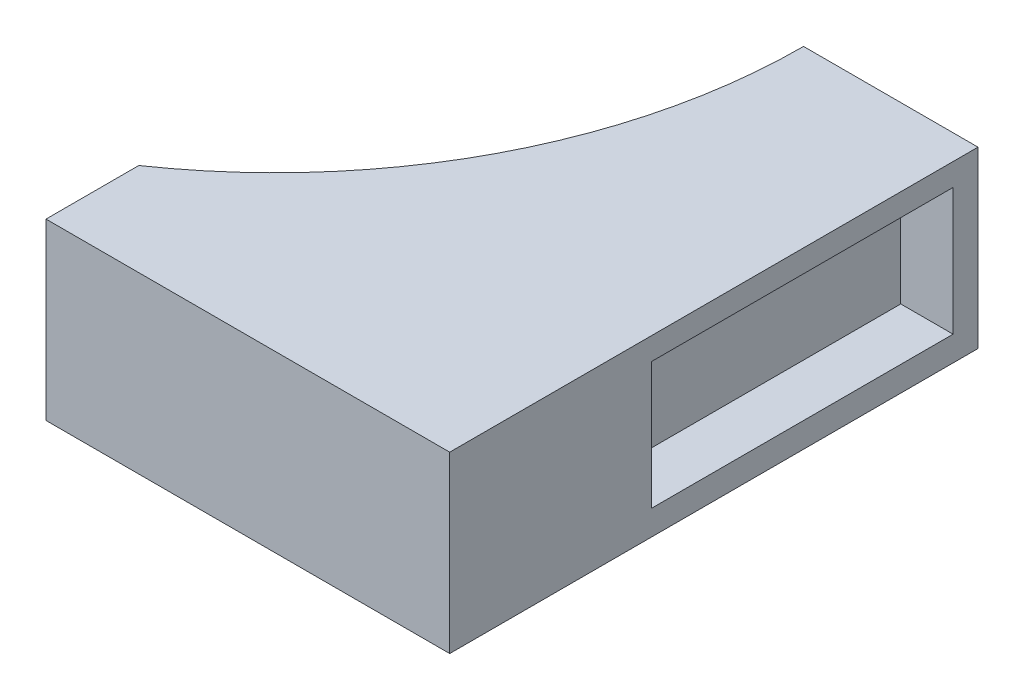
ISO-10303-21;
HEADER;
FILE_DESCRIPTION(('STEP AP214'),'2;1');
FILE_NAME('part.step','',(''),(''),'','','');
FILE_SCHEMA(('AUTOMOTIVE_DESIGN { 1 0 10303 214 1 1 1 1 }'));
ENDSEC;
DATA;
#1=APPLICATION_CONTEXT('core data for automotive mechanical design processes');
#2=APPLICATION_PROTOCOL_DEFINITION('international standard','automotive_design',2000,#1);
#3=PRODUCT_CONTEXT('',#1,'mechanical');
#4=PRODUCT('Part','Part','',(#3));
#5=PRODUCT_RELATED_PRODUCT_CATEGORY('part','',(#4));
#6=PRODUCT_DEFINITION_FORMATION('','',#4);
#7=PRODUCT_DEFINITION_CONTEXT('part definition',#1,'design');
#8=PRODUCT_DEFINITION('design','',#6,#7);
#9=PRODUCT_DEFINITION_SHAPE('','',#8);
#10=(LENGTH_UNIT() NAMED_UNIT(*) SI_UNIT(.MILLI.,.METRE.));
#11=(NAMED_UNIT(*) PLANE_ANGLE_UNIT() SI_UNIT($,.RADIAN.));
#12=(NAMED_UNIT(*) SI_UNIT($,.STERADIAN.) SOLID_ANGLE_UNIT());
#13=UNCERTAINTY_MEASURE_WITH_UNIT(LENGTH_MEASURE(1.E-05),#10,'distance_accuracy_value','');
#14=(GEOMETRIC_REPRESENTATION_CONTEXT(3) GLOBAL_UNCERTAINTY_ASSIGNED_CONTEXT((#13)) GLOBAL_UNIT_ASSIGNED_CONTEXT((#10,
#11,#12)) REPRESENTATION_CONTEXT('',''));
#15=CARTESIAN_POINT('',(0.,0.,0.));
#16=DIRECTION('',(0.,0.,1.));
#17=DIRECTION('',(1.,0.,0.));
#18=AXIS2_PLACEMENT_3D('',#15,#16,#17);
#19=CARTESIAN_POINT('',(-21.2,7.,0.));
#20=DIRECTION('',(0.,-1.,0.));
#21=DIRECTION('',(0.,0.,1.));
#22=AXIS2_PLACEMENT_3D('',#19,#20,#21);
#23=CYLINDRICAL_SURFACE('',#22,21.2);
#24=CARTESIAN_POINT('',(-21.2,3.,0.));
#25=DIRECTION('',(0.,1.,0.));
#26=DIRECTION('',(0.,0.,1.));
#27=AXIS2_PLACEMENT_3D('',#24,#25,#26);
#28=CIRCLE('',#27,21.2);
#29=CARTESIAN_POINT('',(-0.0945504667633247,3.,2.));
#30=VERTEX_POINT('',#29);
#31=CARTESIAN_POINT('',(-8.5335087731448,3.,17.));
#32=VERTEX_POINT('',#31);
#33=EDGE_CURVE('E50',#30,#32,#28,.F.);
#34=ORIENTED_EDGE('',*,*,#33,.F.);
#35=DIRECTION('',(0.,-1.,0.));
#36=VECTOR('',#35,1.);
#37=CARTESIAN_POINT('',(-0.0945504667633247,7.,2.));
#38=LINE('',#37,#36);
#39=CARTESIAN_POINT('',(-0.0945504667633247,6.,2.));
#40=VERTEX_POINT('',#39);
#41=EDGE_CURVE('E276',#40,#30,#38,.T.);
#42=ORIENTED_EDGE('',*,*,#41,.F.);
#43=CARTESIAN_POINT('',(-21.2,6.,0.));
#44=DIRECTION('',(0.,-1.,0.));
#45=DIRECTION('',(0.,0.,-1.));
#46=AXIS2_PLACEMENT_3D('',#43,#44,#45);
#47=CIRCLE('',#46,21.2);
#48=CARTESIAN_POINT('',(-8.5335087731448,6.,17.));
#49=VERTEX_POINT('',#48);
#50=EDGE_CURVE('E273',#49,#40,#47,.F.);
#51=ORIENTED_EDGE('',*,*,#50,.F.);
#52=DIRECTION('',(0.,-1.,0.));
#53=VECTOR('',#52,1.);
#54=CARTESIAN_POINT('',(-8.5335087731448,7.,17.));
#55=LINE('',#54,#53);
#56=EDGE_CURVE('E11',#32,#49,#55,.F.);
#57=ORIENTED_EDGE('',*,*,#56,.F.);
#58=EDGE_LOOP('',(#34,#42,#51,#57));
#59=FACE_BOUND('',#58,.T.);
#60=CARTESIAN_POINT('',(-21.2,7.,0.));
#61=DIRECTION('',(0.,1.,0.));
#62=DIRECTION('',(0.,0.,1.));
#63=AXIS2_PLACEMENT_3D('',#60,#61,#62);
#64=CIRCLE('',#63,21.2);
#65=CARTESIAN_POINT('',(-9.2,7.,17.4768418199628));
#66=VERTEX_POINT('',#65);
#67=CARTESIAN_POINT('',(0.,7.,0.));
#68=VERTEX_POINT('',#67);
#69=EDGE_CURVE('E230',#66,#68,#64,.T.);
#70=ORIENTED_EDGE('',*,*,#69,.T.);
#71=DIRECTION('',(0.,-1.,0.));
#72=VECTOR('',#71,1.);
#73=CARTESIAN_POINT('',(0.,7.,0.));
#74=LINE('',#73,#72);
#75=CARTESIAN_POINT('',(0.,0.,0.));
#76=VERTEX_POINT('',#75);
#77=EDGE_CURVE('E269',#68,#76,#74,.T.);
#78=ORIENTED_EDGE('',*,*,#77,.T.);
#79=CARTESIAN_POINT('',(-21.2,0.,0.));
#80=DIRECTION('',(0.,1.,0.));
#81=DIRECTION('',(0.,0.,1.));
#82=AXIS2_PLACEMENT_3D('',#79,#80,#81);
#83=CIRCLE('',#82,21.2);
#84=CARTESIAN_POINT('',(-9.2,0.,17.4768418199628));
#85=VERTEX_POINT('',#84);
#86=EDGE_CURVE('E226',#85,#76,#83,.T.);
#87=ORIENTED_EDGE('',*,*,#86,.F.);
#88=DIRECTION('',(0.,1.,0.));
#89=VECTOR('',#88,1.);
#90=CARTESIAN_POINT('',(-9.2,0.,17.4768418199628));
#91=LINE('',#90,#89);
#92=EDGE_CURVE('E219',#85,#66,#91,.T.);
#93=ORIENTED_EDGE('',*,*,#92,.T.);
#94=EDGE_LOOP('',(#70,#78,#87,#93));
#95=FACE_BOUND('',#94,.T.);
#96=ADVANCED_FACE('F42',(#59,#95),#23,.F.);
#97=CARTESIAN_POINT('',(0.,7.,0.));
#98=DIRECTION('',(0.,0.,1.));
#99=DIRECTION('',(-1.,0.,0.));
#100=AXIS2_PLACEMENT_3D('',#97,#98,#99);
#101=PLANE('',#100);
#102=DIRECTION('',(1.,0.,0.));
#103=VECTOR('',#102,1.);
#104=CARTESIAN_POINT('',(0.,0.,0.));
#105=LINE('',#104,#103);
#106=CARTESIAN_POINT('',(7.,0.,0.));
#107=VERTEX_POINT('',#106);
#108=EDGE_CURVE('E251',#76,#107,#105,.T.);
#109=ORIENTED_EDGE('',*,*,#108,.F.);
#110=ORIENTED_EDGE('',*,*,#77,.F.);
#111=DIRECTION('',(1.,0.,0.));
#112=VECTOR('',#111,1.);
#113=CARTESIAN_POINT('',(0.,7.,0.));
#114=LINE('',#113,#112);
#115=CARTESIAN_POINT('',(7.,7.,0.));
#116=VERTEX_POINT('',#115);
#117=EDGE_CURVE('E234',#68,#116,#114,.T.);
#118=ORIENTED_EDGE('',*,*,#117,.T.);
#119=DIRECTION('',(0.,-1.,0.));
#120=VECTOR('',#119,1.);
#121=CARTESIAN_POINT('',(7.,7.,0.));
#122=LINE('',#121,#120);
#123=EDGE_CURVE('E265',#116,#107,#122,.T.);
#124=ORIENTED_EDGE('',*,*,#123,.T.);
#125=EDGE_LOOP('',(#109,#110,#118,#124));
#126=FACE_BOUND('',#125,.T.);
#127=ADVANCED_FACE('F307',(#126),#101,.F.);
#128=CARTESIAN_POINT('',(7.,7.,0.));
#129=DIRECTION('',(-1.,0.,0.));
#130=DIRECTION('',(0.,0.,-1.));
#131=AXIS2_PLACEMENT_3D('',#128,#129,#130);
#132=PLANE('',#131);
#133=DIRECTION('',(0.,0.,1.));
#134=VECTOR('',#133,1.);
#135=CARTESIAN_POINT('',(7.,1.,1.));
#136=LINE('',#135,#134);
#137=CARTESIAN_POINT('',(7.,1.,1.));
#138=VERTEX_POINT('',#137);
#139=CARTESIAN_POINT('',(7.,1.,13.1));
#140=VERTEX_POINT('',#139);
#141=EDGE_CURVE('E154',#138,#140,#136,.T.);
#142=ORIENTED_EDGE('',*,*,#141,.T.);
#143=DIRECTION('',(0.,1.,0.));
#144=VECTOR('',#143,1.);
#145=CARTESIAN_POINT('',(7.,1.,13.1));
#146=LINE('',#145,#144);
#147=CARTESIAN_POINT('',(7.,6.1,13.1));
#148=VERTEX_POINT('',#147);
#149=EDGE_CURVE('E166',#140,#148,#146,.T.);
#150=ORIENTED_EDGE('',*,*,#149,.T.);
#151=DIRECTION('',(0.,0.,-1.));
#152=VECTOR('',#151,1.);
#153=CARTESIAN_POINT('',(7.,6.1,1.));
#154=LINE('',#153,#152);
#155=CARTESIAN_POINT('',(7.,6.1,1.));
#156=VERTEX_POINT('',#155);
#157=EDGE_CURVE('E162',#148,#156,#154,.T.);
#158=ORIENTED_EDGE('',*,*,#157,.T.);
#159=DIRECTION('',(0.,-1.,0.));
#160=VECTOR('',#159,1.);
#161=CARTESIAN_POINT('',(7.,1.,1.));
#162=LINE('',#161,#160);
#163=EDGE_CURVE('E173',#156,#138,#162,.T.);
#164=ORIENTED_EDGE('',*,*,#163,.T.);
#165=EDGE_LOOP('',(#142,#150,#158,#164));
#166=FACE_BOUND('',#165,.T.);
#167=DIRECTION('',(0.,0.,1.));
#168=VECTOR('',#167,1.);
#169=CARTESIAN_POINT('',(7.,0.,0.));
#170=LINE('',#169,#168);
#171=CARTESIAN_POINT('',(7.,0.,21.2));
#172=VERTEX_POINT('',#171);
#173=EDGE_CURVE('E255',#107,#172,#170,.T.);
#174=ORIENTED_EDGE('',*,*,#173,.F.);
#175=ORIENTED_EDGE('',*,*,#123,.F.);
#176=DIRECTION('',(0.,0.,1.));
#177=VECTOR('',#176,1.);
#178=CARTESIAN_POINT('',(7.,7.,0.));
#179=LINE('',#178,#177);
#180=CARTESIAN_POINT('',(7.,7.,21.2));
#181=VERTEX_POINT('',#180);
#182=EDGE_CURVE('E239',#116,#181,#179,.T.);
#183=ORIENTED_EDGE('',*,*,#182,.T.);
#184=DIRECTION('',(0.,-1.,0.));
#185=VECTOR('',#184,1.);
#186=CARTESIAN_POINT('',(7.,7.,21.2));
#187=LINE('',#186,#185);
#188=EDGE_CURVE('E247',#181,#172,#187,.T.);
#189=ORIENTED_EDGE('',*,*,#188,.T.);
#190=EDGE_LOOP('',(#174,#175,#183,#189));
#191=FACE_BOUND('',#190,.T.);
#192=ADVANCED_FACE('F311',(#166,#191),#132,.F.);
#193=CARTESIAN_POINT('',(7.,7.,21.2));
#194=DIRECTION('',(0.,0.,-1.));
#195=DIRECTION('',(1.,0.,0.));
#196=AXIS2_PLACEMENT_3D('',#193,#194,#195);
#197=PLANE('',#196);
#198=DIRECTION('',(-1.,0.,0.));
#199=VECTOR('',#198,1.);
#200=CARTESIAN_POINT('',(7.,0.,21.2));
#201=LINE('',#200,#199);
#202=CARTESIAN_POINT('',(-9.2,0.,21.2));
#203=VERTEX_POINT('',#202);
#204=EDGE_CURVE('E235',#172,#203,#201,.T.);
#205=ORIENTED_EDGE('',*,*,#204,.F.);
#206=ORIENTED_EDGE('',*,*,#188,.F.);
#207=DIRECTION('',(-1.,0.,0.));
#208=VECTOR('',#207,1.);
#209=CARTESIAN_POINT('',(7.,7.,21.2));
#210=LINE('',#209,#208);
#211=CARTESIAN_POINT('',(-9.2,7.,21.2));
#212=VERTEX_POINT('',#211);
#213=EDGE_CURVE('E243',#181,#212,#210,.T.);
#214=ORIENTED_EDGE('',*,*,#213,.T.);
#215=DIRECTION('',(0.,1.,0.));
#216=VECTOR('',#215,1.);
#217=CARTESIAN_POINT('',(-9.2,0.,21.2));
#218=LINE('',#217,#216);
#219=EDGE_CURVE('E222',#203,#212,#218,.T.);
#220=ORIENTED_EDGE('',*,*,#219,.F.);
#221=EDGE_LOOP('',(#205,#206,#214,#220));
#222=FACE_BOUND('',#221,.T.);
#223=ADVANCED_FACE('F316',(#222),#197,.F.);
#224=CARTESIAN_POINT('',(-21.2,7.,0.));
#225=DIRECTION('',(0.,-1.,0.));
#226=DIRECTION('',(0.,0.,1.));
#227=AXIS2_PLACEMENT_3D('',#224,#225,#226);
#228=PLANE('',#227);
#229=ORIENTED_EDGE('',*,*,#213,.F.);
#230=ORIENTED_EDGE('',*,*,#182,.F.);
#231=ORIENTED_EDGE('',*,*,#117,.F.);
#232=ORIENTED_EDGE('',*,*,#69,.F.);
#233=DIRECTION('',(0.,0.,1.));
#234=VECTOR('',#233,1.);
#235=CARTESIAN_POINT('',(-9.2,7.,17.4768418199628));
#236=LINE('',#235,#234);
#237=EDGE_CURVE('E206',#66,#212,#236,.T.);
#238=ORIENTED_EDGE('',*,*,#237,.T.);
#239=EDGE_LOOP('',(#229,#230,#231,#232,#238));
#240=FACE_BOUND('',#239,.T.);
#241=ADVANCED_FACE('F322',(#240),#228,.F.);
#242=CARTESIAN_POINT('',(-21.2,0.,0.));
#243=DIRECTION('',(0.,-1.,0.));
#244=DIRECTION('',(0.,0.,1.));
#245=AXIS2_PLACEMENT_3D('',#242,#243,#244);
#246=PLANE('',#245);
#247=DIRECTION('',(0.,0.,1.));
#248=VECTOR('',#247,1.);
#249=CARTESIAN_POINT('',(-9.2,0.,17.4768418199628));
#250=LINE('',#249,#248);
#251=EDGE_CURVE('E216',#85,#203,#250,.T.);
#252=ORIENTED_EDGE('',*,*,#251,.F.);
#253=ORIENTED_EDGE('',*,*,#86,.T.);
#254=ORIENTED_EDGE('',*,*,#108,.T.);
#255=ORIENTED_EDGE('',*,*,#173,.T.);
#256=ORIENTED_EDGE('',*,*,#204,.T.);
#257=EDGE_LOOP('',(#252,#253,#254,#255,#256));
#258=FACE_BOUND('',#257,.T.);
#259=ADVANCED_FACE('F324',(#258),#246,.T.);
#260=CARTESIAN_POINT('',(-9.2,0.,17.4768418199628));
#261=DIRECTION('',(1.,0.,0.));
#262=DIRECTION('',(0.,0.,1.));
#263=AXIS2_PLACEMENT_3D('',#260,#261,#262);
#264=PLANE('',#263);
#265=ORIENTED_EDGE('',*,*,#237,.F.);
#266=ORIENTED_EDGE('',*,*,#92,.F.);
#267=ORIENTED_EDGE('',*,*,#251,.T.);
#268=ORIENTED_EDGE('',*,*,#219,.T.);
#269=EDGE_LOOP('',(#265,#266,#267,#268));
#270=FACE_BOUND('',#269,.T.);
#271=ADVANCED_FACE('F327',(#270),#264,.F.);
#272=CARTESIAN_POINT('',(-10.,6.,17.));
#273=DIRECTION('',(0.,0.,1.));
#274=DIRECTION('',(-1.,0.,0.));
#275=AXIS2_PLACEMENT_3D('',#272,#273,#274);
#276=PLANE('',#275);
#277=DIRECTION('',(1.,0.,0.));
#278=VECTOR('',#277,1.);
#279=CARTESIAN_POINT('',(-10.,3.,17.));
#280=LINE('',#279,#278);
#281=CARTESIAN_POINT('',(0.,3.,17.));
#282=VERTEX_POINT('',#281);
#283=EDGE_CURVE('E202',#32,#282,#280,.T.);
#284=ORIENTED_EDGE('',*,*,#283,.F.);
#285=ORIENTED_EDGE('',*,*,#56,.T.);
#286=DIRECTION('',(1.,0.,0.));
#287=VECTOR('',#286,1.);
#288=CARTESIAN_POINT('',(-10.,6.,17.));
#289=LINE('',#288,#287);
#290=CARTESIAN_POINT('',(0.,6.,17.));
#291=VERTEX_POINT('',#290);
#292=EDGE_CURVE('E201',#49,#291,#289,.T.);
#293=ORIENTED_EDGE('',*,*,#292,.T.);
#294=DIRECTION('',(0.,1.,0.));
#295=VECTOR('',#294,1.);
#296=CARTESIAN_POINT('',(0.,6.,17.));
#297=LINE('',#296,#295);
#298=EDGE_CURVE('E183',#282,#291,#297,.T.);
#299=ORIENTED_EDGE('',*,*,#298,.F.);
#300=EDGE_LOOP('',(#284,#285,#293,#299));
#301=FACE_BOUND('',#300,.T.);
#302=ADVANCED_FACE('F290',(#301),#276,.F.);
#303=CARTESIAN_POINT('',(-10.,3.,17.));
#304=DIRECTION('',(0.,-1.,0.));
#305=DIRECTION('',(0.,0.,1.));
#306=AXIS2_PLACEMENT_3D('',#303,#304,#305);
#307=PLANE('',#306);
#308=DIRECTION('',(1.,0.,0.));
#309=VECTOR('',#308,1.);
#310=CARTESIAN_POINT('',(-10.,3.,2.));
#311=LINE('',#310,#309);
#312=CARTESIAN_POINT('',(0.,3.,2.));
#313=VERTEX_POINT('',#312);
#314=EDGE_CURVE('E207',#30,#313,#311,.T.);
#315=ORIENTED_EDGE('',*,*,#314,.F.);
#316=ORIENTED_EDGE('',*,*,#33,.T.);
#317=ORIENTED_EDGE('',*,*,#283,.T.);
#318=DIRECTION('',(0.,0.,1.));
#319=VECTOR('',#318,1.);
#320=CARTESIAN_POINT('',(0.,3.,17.));
#321=LINE('',#320,#319);
#322=EDGE_CURVE('E198',#313,#282,#321,.T.);
#323=ORIENTED_EDGE('',*,*,#322,.F.);
#324=EDGE_LOOP('',(#315,#316,#317,#323));
#325=FACE_BOUND('',#324,.T.);
#326=ADVANCED_FACE('F282',(#325),#307,.F.);
#327=CARTESIAN_POINT('',(-10.,6.,2.));
#328=DIRECTION('',(0.,0.,-1.));
#329=DIRECTION('',(1.,0.,0.));
#330=AXIS2_PLACEMENT_3D('',#327,#328,#329);
#331=PLANE('',#330);
#332=DIRECTION('',(1.,0.,0.));
#333=VECTOR('',#332,1.);
#334=CARTESIAN_POINT('',(-10.,6.,2.));
#335=LINE('',#334,#333);
#336=CARTESIAN_POINT('',(0.,6.,2.));
#337=VERTEX_POINT('',#336);
#338=EDGE_CURVE('E65',#40,#337,#335,.T.);
#339=ORIENTED_EDGE('',*,*,#338,.F.);
#340=ORIENTED_EDGE('',*,*,#41,.T.);
#341=ORIENTED_EDGE('',*,*,#314,.T.);
#342=DIRECTION('',(0.,-1.,0.));
#343=VECTOR('',#342,1.);
#344=CARTESIAN_POINT('',(0.,6.,2.));
#345=LINE('',#344,#343);
#346=EDGE_CURVE('E195',#337,#313,#345,.T.);
#347=ORIENTED_EDGE('',*,*,#346,.F.);
#348=EDGE_LOOP('',(#339,#340,#341,#347));
#349=FACE_BOUND('',#348,.T.);
#350=ADVANCED_FACE('F294',(#349),#331,.F.);
#351=CARTESIAN_POINT('',(-10.,6.,17.));
#352=DIRECTION('',(0.,1.,0.));
#353=DIRECTION('',(0.,0.,-1.));
#354=AXIS2_PLACEMENT_3D('',#351,#352,#353);
#355=PLANE('',#354);
#356=ORIENTED_EDGE('',*,*,#292,.F.);
#357=ORIENTED_EDGE('',*,*,#50,.T.);
#358=ORIENTED_EDGE('',*,*,#338,.T.);
#359=DIRECTION('',(0.,0.,-1.));
#360=VECTOR('',#359,1.);
#361=CARTESIAN_POINT('',(0.,6.,17.));
#362=LINE('',#361,#360);
#363=EDGE_CURVE('E192',#291,#337,#362,.T.);
#364=ORIENTED_EDGE('',*,*,#363,.F.);
#365=EDGE_LOOP('',(#356,#357,#358,#364));
#366=FACE_BOUND('',#365,.T.);
#367=ADVANCED_FACE('F296',(#366),#355,.F.);
#368=CARTESIAN_POINT('',(0.,0.,0.));
#369=DIRECTION('',(-1.,0.,0.));
#370=DIRECTION('',(0.,0.,-1.));
#371=AXIS2_PLACEMENT_3D('',#368,#369,#370);
#372=PLANE('',#371);
#373=ORIENTED_EDGE('',*,*,#298,.T.);
#374=ORIENTED_EDGE('',*,*,#363,.T.);
#375=ORIENTED_EDGE('',*,*,#346,.T.);
#376=ORIENTED_EDGE('',*,*,#322,.T.);
#377=EDGE_LOOP('',(#373,#374,#375,#376));
#378=FACE_BOUND('',#377,.T.);
#379=ADVANCED_FACE('F293',(#378),#372,.T.);
#380=CARTESIAN_POINT('',(4.9,1.,1.));
#381=DIRECTION('',(0.,0.,-1.));
#382=DIRECTION('',(0.,-1.,0.));
#383=AXIS2_PLACEMENT_3D('',#380,#381,#382);
#384=PLANE('',#383);
#385=ORIENTED_EDGE('',*,*,#163,.F.);
#386=DIRECTION('',(1.,0.,0.));
#387=VECTOR('',#386,1.);
#388=CARTESIAN_POINT('',(4.9,6.1,1.));
#389=LINE('',#388,#387);
#390=CARTESIAN_POINT('',(4.9,6.1,1.));
#391=VERTEX_POINT('',#390);
#392=EDGE_CURVE('E160',#391,#156,#389,.T.);
#393=ORIENTED_EDGE('',*,*,#392,.F.);
#394=DIRECTION('',(0.,-1.,0.));
#395=VECTOR('',#394,1.);
#396=CARTESIAN_POINT('',(4.9,1.,1.));
#397=LINE('',#396,#395);
#398=CARTESIAN_POINT('',(4.9,1.,1.));
#399=VERTEX_POINT('',#398);
#400=EDGE_CURVE('E144',#391,#399,#397,.T.);
#401=ORIENTED_EDGE('',*,*,#400,.T.);
#402=DIRECTION('',(1.,0.,0.));
#403=VECTOR('',#402,1.);
#404=CARTESIAN_POINT('',(4.9,1.,1.));
#405=LINE('',#404,#403);
#406=EDGE_CURVE('E57',#399,#138,#405,.T.);
#407=ORIENTED_EDGE('',*,*,#406,.T.);
#408=EDGE_LOOP('',(#385,#393,#401,#407));
#409=FACE_BOUND('',#408,.T.);
#410=ADVANCED_FACE('F159',(#409),#384,.F.);
#411=CARTESIAN_POINT('',(4.9,6.1,1.));
#412=DIRECTION('',(0.,1.,0.));
#413=DIRECTION('',(0.,0.,-1.));
#414=AXIS2_PLACEMENT_3D('',#411,#412,#413);
#415=PLANE('',#414);
#416=ORIENTED_EDGE('',*,*,#157,.F.);
#417=DIRECTION('',(1.,0.,0.));
#418=VECTOR('',#417,1.);
#419=CARTESIAN_POINT('',(4.9,6.1,13.1));
#420=LINE('',#419,#418);
#421=CARTESIAN_POINT('',(4.9,6.1,13.1));
#422=VERTEX_POINT('',#421);
#423=EDGE_CURVE('E184',#422,#148,#420,.T.);
#424=ORIENTED_EDGE('',*,*,#423,.F.);
#425=DIRECTION('',(0.,0.,-1.));
#426=VECTOR('',#425,1.);
#427=CARTESIAN_POINT('',(4.9,6.1,1.));
#428=LINE('',#427,#426);
#429=EDGE_CURVE('E157',#422,#391,#428,.T.);
#430=ORIENTED_EDGE('',*,*,#429,.T.);
#431=ORIENTED_EDGE('',*,*,#392,.T.);
#432=EDGE_LOOP('',(#416,#424,#430,#431));
#433=FACE_BOUND('',#432,.T.);
#434=ADVANCED_FACE('F344',(#433),#415,.F.);
#435=CARTESIAN_POINT('',(4.9,1.,13.1));
#436=DIRECTION('',(0.,0.,1.));
#437=DIRECTION('',(-1.,0.,0.));
#438=AXIS2_PLACEMENT_3D('',#435,#436,#437);
#439=PLANE('',#438);
#440=ORIENTED_EDGE('',*,*,#149,.F.);
#441=DIRECTION('',(1.,0.,0.));
#442=VECTOR('',#441,1.);
#443=CARTESIAN_POINT('',(4.9,1.,13.1));
#444=LINE('',#443,#442);
#445=CARTESIAN_POINT('',(4.9,1.,13.1));
#446=VERTEX_POINT('',#445);
#447=EDGE_CURVE('E156',#446,#140,#444,.T.);
#448=ORIENTED_EDGE('',*,*,#447,.F.);
#449=DIRECTION('',(0.,1.,0.));
#450=VECTOR('',#449,1.);
#451=CARTESIAN_POINT('',(4.9,1.,13.1));
#452=LINE('',#451,#450);
#453=EDGE_CURVE('E146',#446,#422,#452,.T.);
#454=ORIENTED_EDGE('',*,*,#453,.T.);
#455=ORIENTED_EDGE('',*,*,#423,.T.);
#456=EDGE_LOOP('',(#440,#448,#454,#455));
#457=FACE_BOUND('',#456,.T.);
#458=ADVANCED_FACE('F347',(#457),#439,.F.);
#459=CARTESIAN_POINT('',(4.9,1.,1.));
#460=DIRECTION('',(0.,-1.,0.));
#461=DIRECTION('',(0.,0.,1.));
#462=AXIS2_PLACEMENT_3D('',#459,#460,#461);
#463=PLANE('',#462);
#464=ORIENTED_EDGE('',*,*,#141,.F.);
#465=ORIENTED_EDGE('',*,*,#406,.F.);
#466=DIRECTION('',(0.,0.,1.));
#467=VECTOR('',#466,1.);
#468=CARTESIAN_POINT('',(4.9,1.,1.));
#469=LINE('',#468,#467);
#470=EDGE_CURVE('E141',#399,#446,#469,.T.);
#471=ORIENTED_EDGE('',*,*,#470,.T.);
#472=ORIENTED_EDGE('',*,*,#447,.T.);
#473=EDGE_LOOP('',(#464,#465,#471,#472));
#474=FACE_BOUND('',#473,.T.);
#475=ADVANCED_FACE('F152',(#474),#463,.F.);
#476=CARTESIAN_POINT('',(4.9,0.,0.));
#477=DIRECTION('',(-1.,0.,0.));
#478=DIRECTION('',(0.,0.,-1.));
#479=AXIS2_PLACEMENT_3D('',#476,#477,#478);
#480=PLANE('',#479);
#481=ORIENTED_EDGE('',*,*,#400,.F.);
#482=ORIENTED_EDGE('',*,*,#429,.F.);
#483=ORIENTED_EDGE('',*,*,#453,.F.);
#484=ORIENTED_EDGE('',*,*,#470,.F.);
#485=EDGE_LOOP('',(#481,#482,#483,#484));
#486=FACE_BOUND('',#485,.T.);
#487=ADVANCED_FACE('F142',(#486),#480,.F.);
#488=CLOSED_SHELL('',(#96,#127,#192,#223,#241,#259,#271,#302,#326,#350,#367,#379,#410,#434,#458,
#475,#487));
#489=MANIFOLD_SOLID_BREP('B2',#488);
#490=ADVANCED_BREP_SHAPE_REPRESENTATION('',(#18,#489),#14);
#491=SHAPE_DEFINITION_REPRESENTATION(#9,#490);
ENDSEC;
END-ISO-10303-21;
